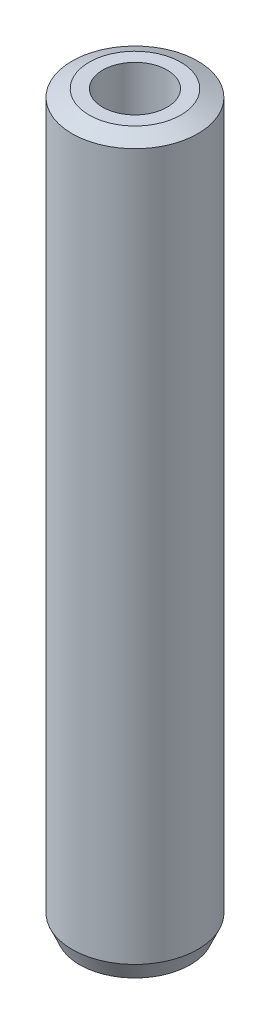
ISO-10303-21;
HEADER;
FILE_DESCRIPTION(('STEP AP214'),'2;1');
FILE_NAME('part.step','',(''),(''),'','','');
FILE_SCHEMA(('AUTOMOTIVE_DESIGN { 1 0 10303 214 1 1 1 1 }'));
ENDSEC;
DATA;
#1=APPLICATION_CONTEXT('core data for automotive mechanical design processes');
#2=APPLICATION_PROTOCOL_DEFINITION('international standard','automotive_design',2000,#1);
#3=PRODUCT_CONTEXT('',#1,'mechanical');
#4=PRODUCT('Part','Part','',(#3));
#5=PRODUCT_RELATED_PRODUCT_CATEGORY('part','',(#4));
#6=PRODUCT_DEFINITION_FORMATION('','',#4);
#7=PRODUCT_DEFINITION_CONTEXT('part definition',#1,'design');
#8=PRODUCT_DEFINITION('design','',#6,#7);
#9=PRODUCT_DEFINITION_SHAPE('','',#8);
#10=(LENGTH_UNIT() NAMED_UNIT(*) SI_UNIT(.MILLI.,.METRE.));
#11=(NAMED_UNIT(*) PLANE_ANGLE_UNIT() SI_UNIT($,.RADIAN.));
#12=(NAMED_UNIT(*) SI_UNIT($,.STERADIAN.) SOLID_ANGLE_UNIT());
#13=UNCERTAINTY_MEASURE_WITH_UNIT(LENGTH_MEASURE(1.E-05),#10,'distance_accuracy_value','');
#14=(GEOMETRIC_REPRESENTATION_CONTEXT(3) GLOBAL_UNCERTAINTY_ASSIGNED_CONTEXT((#13)) GLOBAL_UNIT_ASSIGNED_CONTEXT((#10,
#11,#12)) REPRESENTATION_CONTEXT('',''));
#15=CARTESIAN_POINT('',(0.,0.,0.));
#16=DIRECTION('',(0.,0.,1.));
#17=DIRECTION('',(1.,0.,0.));
#18=AXIS2_PLACEMENT_3D('',#15,#16,#17);
#19=CARTESIAN_POINT('',(0.,203.344943854085,0.));
#20=DIRECTION('',(0.,-1.,0.));
#21=DIRECTION('',(0.,0.,-1.));
#22=AXIS2_PLACEMENT_3D('',#19,#20,#21);
#23=CYLINDRICAL_SURFACE('',#22,17.5);
#24=CARTESIAN_POINT('',(0.,201.239878891395,0.));
#25=DIRECTION('',(0.,1.,0.));
#26=DIRECTION('',(0.,0.,1.));
#27=AXIS2_PLACEMENT_3D('',#24,#25,#26);
#28=CIRCLE('',#27,17.5);
#29=CARTESIAN_POINT('',(0.,201.239878891395,17.5));
#30=VERTEX_POINT('',#29);
#31=EDGE_CURVE('E50',#30,#30,#28,.F.);
#32=ORIENTED_EDGE('',*,*,#31,.T.);
#33=EDGE_LOOP('',(#32));
#34=FACE_BOUND('',#33,.T.);
#35=CARTESIAN_POINT('',(0.,4.75549355416408,0.));
#36=DIRECTION('',(0.,1.,0.));
#37=DIRECTION('',(0.,0.,1.));
#38=AXIS2_PLACEMENT_3D('',#35,#36,#37);
#39=CIRCLE('',#38,17.5);
#40=CARTESIAN_POINT('',(0.,4.75549355416408,17.5));
#41=VERTEX_POINT('',#40);
#42=EDGE_CURVE('E51',#41,#41,#39,.T.);
#43=ORIENTED_EDGE('',*,*,#42,.T.);
#44=EDGE_LOOP('',(#43));
#45=FACE_BOUND('',#44,.T.);
#46=ADVANCED_FACE('F39',(#34,#45),#23,.T.);
#47=CARTESIAN_POINT('',(0.,203.344943854085,0.));
#48=DIRECTION('',(0.,1.,0.));
#49=DIRECTION('',(0.,0.,1.));
#50=AXIS2_PLACEMENT_3D('',#47,#48,#49);
#51=PLANE('',#50);
#52=CARTESIAN_POINT('',(0.,203.344943854085,0.));
#53=DIRECTION('',(0.,1.,0.));
#54=DIRECTION('',(0.,0.,1.));
#55=AXIS2_PLACEMENT_3D('',#52,#53,#54);
#56=CIRCLE('',#55,12.7445064458359);
#57=CARTESIAN_POINT('',(0.,203.344943854085,12.7445064458359));
#58=VERTEX_POINT('',#57);
#59=EDGE_CURVE('E54',#58,#58,#56,.T.);
#60=ORIENTED_EDGE('',*,*,#59,.T.);
#61=EDGE_LOOP('',(#60));
#62=FACE_BOUND('',#61,.T.);
#63=CARTESIAN_POINT('',(0.,203.344943854085,0.));
#64=DIRECTION('',(0.,1.,0.));
#65=DIRECTION('',(0.,0.,1.));
#66=AXIS2_PLACEMENT_3D('',#63,#64,#65);
#67=CIRCLE('',#66,8.96533883071189);
#68=CARTESIAN_POINT('',(0.,203.344943854085,8.96533883071189));
#69=VERTEX_POINT('',#68);
#70=EDGE_CURVE('E58',#69,#69,#67,.T.);
#71=ORIENTED_EDGE('',*,*,#70,.F.);
#72=EDGE_LOOP('',(#71));
#73=FACE_BOUND('',#72,.T.);
#74=ADVANCED_FACE('F69',(#62,#73),#51,.T.);
#75=CARTESIAN_POINT('',(0.,0.,0.));
#76=DIRECTION('',(0.,1.,0.));
#77=DIRECTION('',(0.,0.,1.));
#78=AXIS2_PLACEMENT_3D('',#75,#76,#77);
#79=PLANE('',#78);
#80=CARTESIAN_POINT('',(0.,0.,0.));
#81=DIRECTION('',(0.,1.,0.));
#82=DIRECTION('',(0.,0.,1.));
#83=AXIS2_PLACEMENT_3D('',#80,#81,#82);
#84=CIRCLE('',#83,15.3949350373104);
#85=CARTESIAN_POINT('',(0.,0.,15.3949350373104));
#86=VERTEX_POINT('',#85);
#87=EDGE_CURVE('E10',#86,#86,#84,.F.);
#88=ORIENTED_EDGE('',*,*,#87,.T.);
#89=EDGE_LOOP('',(#88));
#90=FACE_BOUND('',#89,.T.);
#91=CARTESIAN_POINT('',(0.,0.,0.));
#92=DIRECTION('',(0.,1.,0.));
#93=DIRECTION('',(0.,0.,1.));
#94=AXIS2_PLACEMENT_3D('',#91,#92,#93);
#95=CIRCLE('',#94,8.96533883071189);
#96=CARTESIAN_POINT('',(0.,0.,8.96533883071189));
#97=VERTEX_POINT('',#96);
#98=EDGE_CURVE('E63',#97,#97,#95,.T.);
#99=ORIENTED_EDGE('',*,*,#98,.T.);
#100=EDGE_LOOP('',(#99));
#101=FACE_BOUND('',#100,.T.);
#102=ADVANCED_FACE('F75',(#90,#101),#79,.F.);
#103=CARTESIAN_POINT('',(0.,203.344943854085,0.));
#104=DIRECTION('',(0.,-1.,0.));
#105=DIRECTION('',(0.,0.,-1.));
#106=AXIS2_PLACEMENT_3D('',#103,#104,#105);
#107=CYLINDRICAL_SURFACE('',#106,8.96533883071189);
#108=ORIENTED_EDGE('',*,*,#70,.T.);
#109=EDGE_LOOP('',(#108));
#110=FACE_BOUND('',#109,.T.);
#111=ORIENTED_EDGE('',*,*,#98,.F.);
#112=EDGE_LOOP('',(#111));
#113=FACE_BOUND('',#112,.T.);
#114=ADVANCED_FACE('F70',(#110,#113),#107,.F.);
#115=CARTESIAN_POINT('',(0.,203.344943854085,0.));
#116=DIRECTION('',(0.,-1.,0.));
#117=DIRECTION('',(0.,0.,-1.));
#118=AXIS2_PLACEMENT_3D('',#115,#116,#117);
#119=CONICAL_SURFACE('',#118,12.7445064458359,1.1540634056595);
#120=ORIENTED_EDGE('',*,*,#31,.F.);
#121=EDGE_LOOP('',(#120));
#122=FACE_BOUND('',#121,.T.);
#123=ORIENTED_EDGE('',*,*,#59,.F.);
#124=EDGE_LOOP('',(#123));
#125=FACE_BOUND('',#124,.T.);
#126=ADVANCED_FACE('F81',(#122,#125),#119,.T.);
#127=CARTESIAN_POINT('',(0.,4.75549355416408,0.));
#128=DIRECTION('',(0.,1.,0.));
#129=DIRECTION('',(0.,0.,1.));
#130=AXIS2_PLACEMENT_3D('',#127,#128,#129);
#131=CONICAL_SURFACE('',#130,17.5,0.416732921135399);
#132=ORIENTED_EDGE('',*,*,#87,.F.);
#133=EDGE_LOOP('',(#132));
#134=FACE_BOUND('',#133,.T.);
#135=ORIENTED_EDGE('',*,*,#42,.F.);
#136=EDGE_LOOP('',(#135));
#137=FACE_BOUND('',#136,.T.);
#138=ADVANCED_FACE('F45',(#134,#137),#131,.T.);
#139=CLOSED_SHELL('',(#46,#74,#102,#114,#126,#138));
#140=MANIFOLD_SOLID_BREP('B2',#139);
#141=ADVANCED_BREP_SHAPE_REPRESENTATION('',(#18,#140),#14);
#142=SHAPE_DEFINITION_REPRESENTATION(#9,#141);
ENDSEC;
END-ISO-10303-21;
